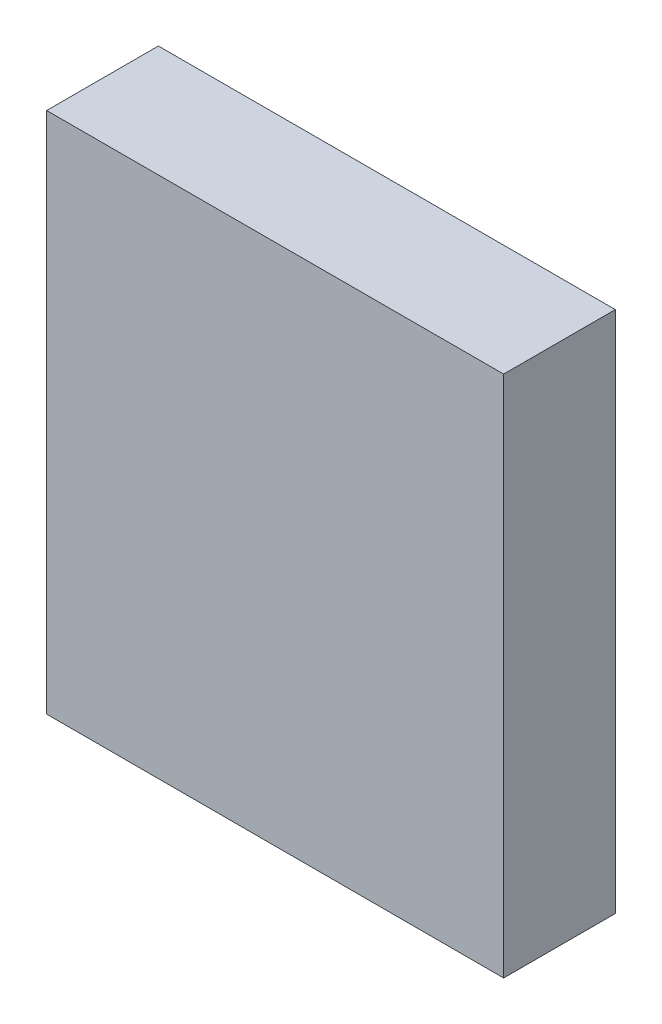
ISO-10303-21;
HEADER;
FILE_DESCRIPTION(('STEP AP214'),'2;1');
FILE_NAME('part.step','',(''),(''),'','','');
FILE_SCHEMA(('AUTOMOTIVE_DESIGN { 1 0 10303 214 1 1 1 1 }'));
ENDSEC;
DATA;
#1=APPLICATION_CONTEXT('core data for automotive mechanical design processes');
#2=APPLICATION_PROTOCOL_DEFINITION('international standard','automotive_design',2000,#1);
#3=PRODUCT_CONTEXT('',#1,'mechanical');
#4=PRODUCT('Part','Part','',(#3));
#5=PRODUCT_RELATED_PRODUCT_CATEGORY('part','',(#4));
#6=PRODUCT_DEFINITION_FORMATION('','',#4);
#7=PRODUCT_DEFINITION_CONTEXT('part definition',#1,'design');
#8=PRODUCT_DEFINITION('design','',#6,#7);
#9=PRODUCT_DEFINITION_SHAPE('','',#8);
#10=(LENGTH_UNIT() NAMED_UNIT(*) SI_UNIT(.MILLI.,.METRE.));
#11=(NAMED_UNIT(*) PLANE_ANGLE_UNIT() SI_UNIT($,.RADIAN.));
#12=(NAMED_UNIT(*) SI_UNIT($,.STERADIAN.) SOLID_ANGLE_UNIT());
#13=UNCERTAINTY_MEASURE_WITH_UNIT(LENGTH_MEASURE(1.E-05),#10,'distance_accuracy_value','');
#14=(GEOMETRIC_REPRESENTATION_CONTEXT(3) GLOBAL_UNCERTAINTY_ASSIGNED_CONTEXT((#13)) GLOBAL_UNIT_ASSIGNED_CONTEXT((#10,
#11,#12)) REPRESENTATION_CONTEXT('',''));
#15=CARTESIAN_POINT('',(0.,0.,0.));
#16=DIRECTION('',(0.,0.,1.));
#17=DIRECTION('',(1.,0.,0.));
#18=AXIS2_PLACEMENT_3D('',#15,#16,#17);
#19=CARTESIAN_POINT('',(2.25000058,2.5750012,1.10000034));
#20=DIRECTION('',(0.,0.,1.));
#21=DIRECTION('',(1.,0.,0.));
#22=AXIS2_PLACEMENT_3D('',#19,#20,#21);
#23=PLANE('',#22);
#24=DIRECTION('',(1.,0.,0.));
#25=VECTOR('',#24,1.);
#26=CARTESIAN_POINT('',(2.25000058,-2.5750012,1.10000034));
#27=LINE('',#26,#25);
#28=CARTESIAN_POINT('',(2.25000058,-2.5750012,1.10000034));
#29=VERTEX_POINT('',#28);
#30=CARTESIAN_POINT('',(-2.24999804,-2.5750012,1.10000034));
#31=VERTEX_POINT('',#30);
#32=EDGE_CURVE('E53',#29,#31,#27,.F.);
#33=ORIENTED_EDGE('',*,*,#32,.F.);
#34=DIRECTION('',(0.,1.,0.));
#35=VECTOR('',#34,1.);
#36=CARTESIAN_POINT('',(2.25000058,2.5750012,1.10000034));
#37=LINE('',#36,#35);
#38=CARTESIAN_POINT('',(2.25000058,2.57500119999999,1.10000034));
#39=VERTEX_POINT('',#38);
#40=EDGE_CURVE('E68',#39,#29,#37,.F.);
#41=ORIENTED_EDGE('',*,*,#40,.F.);
#42=DIRECTION('',(-0.999999877757898,-0.00049445342451915,0.));
#43=VECTOR('',#42,1.);
#44=CARTESIAN_POINT('',(-2.24999804,2.57277616,1.10000034));
#45=LINE('',#44,#43);
#46=CARTESIAN_POINT('',(-2.24999804,2.57277616,1.10000034));
#47=VERTEX_POINT('',#46);
#48=EDGE_CURVE('E20',#47,#39,#45,.F.);
#49=ORIENTED_EDGE('',*,*,#48,.F.);
#50=DIRECTION('',(0.,1.,0.));
#51=VECTOR('',#50,1.);
#52=CARTESIAN_POINT('',(-2.24999804,-2.5750012,1.10000034));
#53=LINE('',#52,#51);
#54=EDGE_CURVE('E58',#31,#47,#53,.T.);
#55=ORIENTED_EDGE('',*,*,#54,.F.);
#56=EDGE_LOOP('',(#33,#41,#49,#55));
#57=FACE_BOUND('',#56,.T.);
#58=ADVANCED_FACE('F17',(#57),#23,.T.);
#59=CARTESIAN_POINT('',(-2.24999804,2.57277616,0.));
#60=DIRECTION('',(-0.00049445342451915,0.999999877757898,0.));
#61=DIRECTION('',(-0.999999877757898,-0.00049445342451915,0.));
#62=AXIS2_PLACEMENT_3D('',#59,#60,#61);
#63=PLANE('',#62);
#64=DIRECTION('',(0.,0.,-1.));
#65=VECTOR('',#64,1.);
#66=CARTESIAN_POINT('',(2.25000058,2.5750012,0.));
#67=LINE('',#66,#65);
#68=CARTESIAN_POINT('',(2.25000058,2.57500119999999,0.));
#69=VERTEX_POINT('',#68);
#70=EDGE_CURVE('E79',#69,#39,#67,.F.);
#71=ORIENTED_EDGE('',*,*,#70,.F.);
#72=DIRECTION('',(-0.999999877757898,-0.000494453424522718,0.));
#73=VECTOR('',#72,1.);
#74=CARTESIAN_POINT('',(2.25000058,2.5750012,0.));
#75=LINE('',#74,#73);
#76=CARTESIAN_POINT('',(-2.24999804,2.57277616,0.));
#77=VERTEX_POINT('',#76);
#78=EDGE_CURVE('E74',#69,#77,#75,.T.);
#79=ORIENTED_EDGE('',*,*,#78,.T.);
#80=DIRECTION('',(0.,0.,1.));
#81=VECTOR('',#80,1.);
#82=CARTESIAN_POINT('',(-2.24999804,2.57277616,0.));
#83=LINE('',#82,#81);
#84=EDGE_CURVE('E63',#47,#77,#83,.F.);
#85=ORIENTED_EDGE('',*,*,#84,.F.);
#86=ORIENTED_EDGE('',*,*,#48,.T.);
#87=EDGE_LOOP('',(#71,#79,#85,#86));
#88=FACE_BOUND('',#87,.T.);
#89=ADVANCED_FACE('F73',(#88),#63,.T.);
#90=CARTESIAN_POINT('',(-2.24999804,-2.5750012,0.));
#91=DIRECTION('',(-1.,0.,0.));
#92=DIRECTION('',(0.,0.,1.));
#93=AXIS2_PLACEMENT_3D('',#90,#91,#92);
#94=PLANE('',#93);
#95=ORIENTED_EDGE('',*,*,#84,.T.);
#96=DIRECTION('',(0.,1.,0.));
#97=VECTOR('',#96,1.);
#98=CARTESIAN_POINT('',(-2.24999804,2.5750012,0.));
#99=LINE('',#98,#97);
#100=CARTESIAN_POINT('',(-2.24999804,-2.5750012,0.));
#101=VERTEX_POINT('',#100);
#102=EDGE_CURVE('E84',#77,#101,#99,.F.);
#103=ORIENTED_EDGE('',*,*,#102,.T.);
#104=DIRECTION('',(0.,0.,-1.));
#105=VECTOR('',#104,1.);
#106=CARTESIAN_POINT('',(-2.24999804,-2.5750012,0.));
#107=LINE('',#106,#105);
#108=EDGE_CURVE('E65',#31,#101,#107,.T.);
#109=ORIENTED_EDGE('',*,*,#108,.F.);
#110=ORIENTED_EDGE('',*,*,#54,.T.);
#111=EDGE_LOOP('',(#95,#103,#109,#110));
#112=FACE_BOUND('',#111,.T.);
#113=ADVANCED_FACE('F60',(#112),#94,.T.);
#114=CARTESIAN_POINT('',(2.25000058,-2.5750012,0.));
#115=DIRECTION('',(0.,-1.,0.));
#116=DIRECTION('',(0.,0.,-1.));
#117=AXIS2_PLACEMENT_3D('',#114,#115,#116);
#118=PLANE('',#117);
#119=ORIENTED_EDGE('',*,*,#108,.T.);
#120=DIRECTION('',(1.,0.,0.));
#121=VECTOR('',#120,1.);
#122=CARTESIAN_POINT('',(2.25000058,-2.5750012,0.));
#123=LINE('',#122,#121);
#124=CARTESIAN_POINT('',(2.25000058,-2.5750012,0.));
#125=VERTEX_POINT('',#124);
#126=EDGE_CURVE('E26',#101,#125,#123,.T.);
#127=ORIENTED_EDGE('',*,*,#126,.T.);
#128=DIRECTION('',(0.,0.,-1.));
#129=VECTOR('',#128,1.);
#130=CARTESIAN_POINT('',(2.25000058,-2.5750012,0.));
#131=LINE('',#130,#129);
#132=EDGE_CURVE('E34',#29,#125,#131,.T.);
#133=ORIENTED_EDGE('',*,*,#132,.F.);
#134=ORIENTED_EDGE('',*,*,#32,.T.);
#135=EDGE_LOOP('',(#119,#127,#133,#134));
#136=FACE_BOUND('',#135,.T.);
#137=ADVANCED_FACE('F88',(#136),#118,.T.);
#138=CARTESIAN_POINT('',(2.25000058,2.5750012,0.));
#139=DIRECTION('',(1.,0.,0.));
#140=DIRECTION('',(0.,0.,-1.));
#141=AXIS2_PLACEMENT_3D('',#138,#139,#140);
#142=PLANE('',#141);
#143=ORIENTED_EDGE('',*,*,#132,.T.);
#144=DIRECTION('',(0.,1.,0.));
#145=VECTOR('',#144,1.);
#146=CARTESIAN_POINT('',(2.25000058,2.5750012,0.));
#147=LINE('',#146,#145);
#148=EDGE_CURVE('E11',#125,#69,#147,.T.);
#149=ORIENTED_EDGE('',*,*,#148,.T.);
#150=ORIENTED_EDGE('',*,*,#70,.T.);
#151=ORIENTED_EDGE('',*,*,#40,.T.);
#152=EDGE_LOOP('',(#143,#149,#150,#151));
#153=FACE_BOUND('',#152,.T.);
#154=ADVANCED_FACE('F91',(#153),#142,.T.);
#155=CARTESIAN_POINT('',(2.25000058,2.5750012,0.));
#156=DIRECTION('',(0.,0.,1.));
#157=DIRECTION('',(1.,0.,0.));
#158=AXIS2_PLACEMENT_3D('',#155,#156,#157);
#159=PLANE('',#158);
#160=ORIENTED_EDGE('',*,*,#126,.F.);
#161=ORIENTED_EDGE('',*,*,#102,.F.);
#162=ORIENTED_EDGE('',*,*,#78,.F.);
#163=ORIENTED_EDGE('',*,*,#148,.F.);
#164=EDGE_LOOP('',(#160,#161,#162,#163));
#165=FACE_BOUND('',#164,.T.);
#166=ADVANCED_FACE('F90',(#165),#159,.F.);
#167=CLOSED_SHELL('',(#58,#89,#113,#137,#154,#166));
#168=MANIFOLD_SOLID_BREP('B1',#167);
#169=ADVANCED_BREP_SHAPE_REPRESENTATION('',(#18,#168),#14);
#170=SHAPE_DEFINITION_REPRESENTATION(#9,#169);
ENDSEC;
END-ISO-10303-21;
